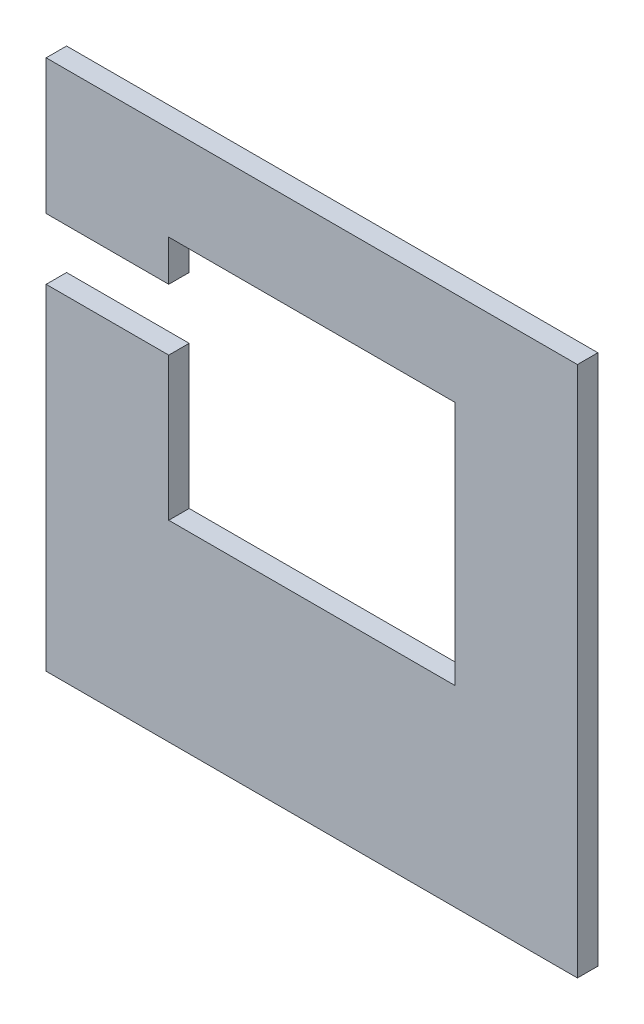
ISO-10303-21;
HEADER;
FILE_DESCRIPTION(('STEP AP214'),'2;1');
FILE_NAME('part.step','',(''),(''),'','','');
FILE_SCHEMA(('AUTOMOTIVE_DESIGN { 1 0 10303 214 1 1 1 1 }'));
ENDSEC;
DATA;
#1=APPLICATION_CONTEXT('core data for automotive mechanical design processes');
#2=APPLICATION_PROTOCOL_DEFINITION('international standard','automotive_design',2000,#1);
#3=PRODUCT_CONTEXT('',#1,'mechanical');
#4=PRODUCT('Part','Part','',(#3));
#5=PRODUCT_RELATED_PRODUCT_CATEGORY('part','',(#4));
#6=PRODUCT_DEFINITION_FORMATION('','',#4);
#7=PRODUCT_DEFINITION_CONTEXT('part definition',#1,'design');
#8=PRODUCT_DEFINITION('design','',#6,#7);
#9=PRODUCT_DEFINITION_SHAPE('','',#8);
#10=(LENGTH_UNIT() NAMED_UNIT(*) SI_UNIT(.MILLI.,.METRE.));
#11=(NAMED_UNIT(*) PLANE_ANGLE_UNIT() SI_UNIT($,.RADIAN.));
#12=(NAMED_UNIT(*) SI_UNIT($,.STERADIAN.) SOLID_ANGLE_UNIT());
#13=UNCERTAINTY_MEASURE_WITH_UNIT(LENGTH_MEASURE(1.E-05),#10,'distance_accuracy_value','');
#14=(GEOMETRIC_REPRESENTATION_CONTEXT(3) GLOBAL_UNCERTAINTY_ASSIGNED_CONTEXT((#13)) GLOBAL_UNIT_ASSIGNED_CONTEXT((#10,
#11,#12)) REPRESENTATION_CONTEXT('',''));
#15=CARTESIAN_POINT('',(0.,0.,0.));
#16=DIRECTION('',(0.,0.,1.));
#17=DIRECTION('',(1.,0.,0.));
#18=AXIS2_PLACEMENT_3D('',#15,#16,#17);
#19=CARTESIAN_POINT('',(-65.,-65.,5.));
#20=DIRECTION('',(1.,0.,0.));
#21=DIRECTION('',(0.,0.,-1.));
#22=AXIS2_PLACEMENT_3D('',#19,#20,#21);
#23=PLANE('',#22);
#24=DIRECTION('',(0.,-1.,0.));
#25=VECTOR('',#24,1.);
#26=CARTESIAN_POINT('',(-65.,-65.,5.));
#27=LINE('',#26,#25);
#28=CARTESIAN_POINT('',(-65.,17.,5.));
#29=VERTEX_POINT('',#28);
#30=CARTESIAN_POINT('',(-65.,-65.,5.));
#31=VERTEX_POINT('',#30);
#32=EDGE_CURVE('E167',#29,#31,#27,.T.);
#33=ORIENTED_EDGE('',*,*,#32,.F.);
#34=DIRECTION('',(0.,0.,1.));
#35=VECTOR('',#34,1.);
#36=CARTESIAN_POINT('',(-65.,17.,-5.));
#37=LINE('',#36,#35);
#38=CARTESIAN_POINT('',(-65.,17.,0.));
#39=VERTEX_POINT('',#38);
#40=EDGE_CURVE('E202',#39,#29,#37,.T.);
#41=ORIENTED_EDGE('',*,*,#40,.F.);
#42=DIRECTION('',(0.,-1.,0.));
#43=VECTOR('',#42,1.);
#44=CARTESIAN_POINT('',(-65.,-65.,0.));
#45=LINE('',#44,#43);
#46=CARTESIAN_POINT('',(-65.,-65.,0.));
#47=VERTEX_POINT('',#46);
#48=EDGE_CURVE('E157',#39,#47,#45,.T.);
#49=ORIENTED_EDGE('',*,*,#48,.T.);
#50=DIRECTION('',(0.,0.,-1.));
#51=VECTOR('',#50,1.);
#52=CARTESIAN_POINT('',(-65.,-65.,5.));
#53=LINE('',#52,#51);
#54=EDGE_CURVE('E127',#31,#47,#53,.T.);
#55=ORIENTED_EDGE('',*,*,#54,.F.);
#56=EDGE_LOOP('',(#33,#41,#49,#55));
#57=FACE_BOUND('',#56,.T.);
#58=ADVANCED_FACE('F34',(#57),#23,.F.);
#59=CARTESIAN_POINT('',(-35.,-18.,0.));
#60=DIRECTION('',(-1.,0.,0.));
#61=DIRECTION('',(0.,-1.,0.));
#62=AXIS2_PLACEMENT_3D('',#59,#60,#61);
#63=PLANE('',#62);
#64=DIRECTION('',(0.,-1.,0.));
#65=VECTOR('',#64,1.);
#66=CARTESIAN_POINT('',(-35.,-18.,0.));
#67=LINE('',#66,#65);
#68=CARTESIAN_POINT('',(-35.,17.,0.));
#69=VERTEX_POINT('',#68);
#70=CARTESIAN_POINT('',(-35.,-18.,0.));
#71=VERTEX_POINT('',#70);
#72=EDGE_CURVE('E155',#69,#71,#67,.T.);
#73=ORIENTED_EDGE('',*,*,#72,.F.);
#74=DIRECTION('',(0.,0.,1.));
#75=VECTOR('',#74,1.);
#76=CARTESIAN_POINT('',(-35.,17.,0.));
#77=LINE('',#76,#75);
#78=CARTESIAN_POINT('',(-35.,17.,5.));
#79=VERTEX_POINT('',#78);
#80=EDGE_CURVE('E11',#69,#79,#77,.T.);
#81=ORIENTED_EDGE('',*,*,#80,.T.);
#82=DIRECTION('',(0.,-1.,0.));
#83=VECTOR('',#82,1.);
#84=CARTESIAN_POINT('',(-35.,-18.,5.));
#85=LINE('',#84,#83);
#86=CARTESIAN_POINT('',(-35.,-18.,5.));
#87=VERTEX_POINT('',#86);
#88=EDGE_CURVE('E141',#79,#87,#85,.T.);
#89=ORIENTED_EDGE('',*,*,#88,.T.);
#90=DIRECTION('',(0.,0.,1.));
#91=VECTOR('',#90,1.);
#92=CARTESIAN_POINT('',(-35.,-18.,0.));
#93=LINE('',#92,#91);
#94=EDGE_CURVE('E162',#71,#87,#93,.T.);
#95=ORIENTED_EDGE('',*,*,#94,.F.);
#96=EDGE_LOOP('',(#73,#81,#89,#95));
#97=FACE_BOUND('',#96,.T.);
#98=ADVANCED_FACE('F246',(#97),#63,.F.);
#99=CARTESIAN_POINT('',(-65.,65.,0.));
#100=VERTEX_POINT('',#99);
#101=CARTESIAN_POINT('',(-65.,32.,0.));
#102=VERTEX_POINT('',#101);
#103=EDGE_CURVE('E174',#100,#102,#45,.T.);
#104=ORIENTED_EDGE('',*,*,#103,.T.);
#105=DIRECTION('',(0.,0.,1.));
#106=VECTOR('',#105,1.);
#107=CARTESIAN_POINT('',(-65.,32.,-5.));
#108=LINE('',#107,#106);
#109=CARTESIAN_POINT('',(-65.,32.,5.));
#110=VERTEX_POINT('',#109);
#111=EDGE_CURVE('E219',#102,#110,#108,.T.);
#112=ORIENTED_EDGE('',*,*,#111,.T.);
#113=CARTESIAN_POINT('',(-65.,65.,5.));
#114=VERTEX_POINT('',#113);
#115=EDGE_CURVE('E135',#114,#110,#27,.T.);
#116=ORIENTED_EDGE('',*,*,#115,.F.);
#117=DIRECTION('',(0.,0.,-1.));
#118=VECTOR('',#117,1.);
#119=CARTESIAN_POINT('',(-65.,65.,5.));
#120=LINE('',#119,#118);
#121=EDGE_CURVE('E173',#114,#100,#120,.T.);
#122=ORIENTED_EDGE('',*,*,#121,.T.);
#123=EDGE_LOOP('',(#104,#112,#116,#122));
#124=FACE_BOUND('',#123,.T.);
#125=ADVANCED_FACE('F36',(#124),#23,.F.);
#126=CARTESIAN_POINT('',(65.,-65.,5.));
#127=DIRECTION('',(0.,1.,0.));
#128=DIRECTION('',(-1.,0.,0.));
#129=AXIS2_PLACEMENT_3D('',#126,#127,#128);
#130=PLANE('',#129);
#131=DIRECTION('',(1.,0.,0.));
#132=VECTOR('',#131,1.);
#133=CARTESIAN_POINT('',(65.,-65.,0.));
#134=LINE('',#133,#132);
#135=CARTESIAN_POINT('',(65.,-65.,0.));
#136=VERTEX_POINT('',#135);
#137=EDGE_CURVE('E177',#47,#136,#134,.T.);
#138=ORIENTED_EDGE('',*,*,#137,.T.);
#139=DIRECTION('',(0.,0.,-1.));
#140=VECTOR('',#139,1.);
#141=CARTESIAN_POINT('',(65.,-65.,5.));
#142=LINE('',#141,#140);
#143=CARTESIAN_POINT('',(65.,-65.,5.));
#144=VERTEX_POINT('',#143);
#145=EDGE_CURVE('E188',#144,#136,#142,.T.);
#146=ORIENTED_EDGE('',*,*,#145,.F.);
#147=DIRECTION('',(1.,0.,0.));
#148=VECTOR('',#147,1.);
#149=CARTESIAN_POINT('',(65.,-65.,5.));
#150=LINE('',#149,#148);
#151=EDGE_CURVE('E166',#31,#144,#150,.T.);
#152=ORIENTED_EDGE('',*,*,#151,.F.);
#153=ORIENTED_EDGE('',*,*,#54,.T.);
#154=EDGE_LOOP('',(#138,#146,#152,#153));
#155=FACE_BOUND('',#154,.T.);
#156=ADVANCED_FACE('F195',(#155),#130,.F.);
#157=CARTESIAN_POINT('',(65.,-65.,5.));
#158=DIRECTION('',(-1.,0.,0.));
#159=DIRECTION('',(0.,0.,1.));
#160=AXIS2_PLACEMENT_3D('',#157,#158,#159);
#161=PLANE('',#160);
#162=DIRECTION('',(0.,1.,0.));
#163=VECTOR('',#162,1.);
#164=CARTESIAN_POINT('',(65.,-65.,0.));
#165=LINE('',#164,#163);
#166=CARTESIAN_POINT('',(65.,65.,0.));
#167=VERTEX_POINT('',#166);
#168=EDGE_CURVE('E179',#136,#167,#165,.T.);
#169=ORIENTED_EDGE('',*,*,#168,.T.);
#170=DIRECTION('',(0.,0.,-1.));
#171=VECTOR('',#170,1.);
#172=CARTESIAN_POINT('',(65.,65.,5.));
#173=LINE('',#172,#171);
#174=CARTESIAN_POINT('',(65.,65.,5.));
#175=VERTEX_POINT('',#174);
#176=EDGE_CURVE('E185',#175,#167,#173,.T.);
#177=ORIENTED_EDGE('',*,*,#176,.F.);
#178=DIRECTION('',(0.,1.,0.));
#179=VECTOR('',#178,1.);
#180=CARTESIAN_POINT('',(65.,-65.,5.));
#181=LINE('',#180,#179);
#182=EDGE_CURVE('E169',#144,#175,#181,.T.);
#183=ORIENTED_EDGE('',*,*,#182,.F.);
#184=ORIENTED_EDGE('',*,*,#145,.T.);
#185=EDGE_LOOP('',(#169,#177,#183,#184));
#186=FACE_BOUND('',#185,.T.);
#187=ADVANCED_FACE('F211',(#186),#161,.F.);
#188=CARTESIAN_POINT('',(65.,65.,5.));
#189=DIRECTION('',(0.,-1.,0.));
#190=DIRECTION('',(1.,0.,0.));
#191=AXIS2_PLACEMENT_3D('',#188,#189,#190);
#192=PLANE('',#191);
#193=DIRECTION('',(-1.,0.,0.));
#194=VECTOR('',#193,1.);
#195=CARTESIAN_POINT('',(65.,65.,0.));
#196=LINE('',#195,#194);
#197=EDGE_CURVE('E181',#167,#100,#196,.T.);
#198=ORIENTED_EDGE('',*,*,#197,.T.);
#199=ORIENTED_EDGE('',*,*,#121,.F.);
#200=DIRECTION('',(-1.,0.,0.));
#201=VECTOR('',#200,1.);
#202=CARTESIAN_POINT('',(65.,65.,5.));
#203=LINE('',#202,#201);
#204=EDGE_CURVE('E171',#175,#114,#203,.T.);
#205=ORIENTED_EDGE('',*,*,#204,.F.);
#206=ORIENTED_EDGE('',*,*,#176,.T.);
#207=EDGE_LOOP('',(#198,#199,#205,#206));
#208=FACE_BOUND('',#207,.T.);
#209=ADVANCED_FACE('F215',(#208),#192,.F.);
#210=CARTESIAN_POINT('',(0.,0.,5.));
#211=DIRECTION('',(0.,0.,1.));
#212=DIRECTION('',(1.,0.,0.));
#213=AXIS2_PLACEMENT_3D('',#210,#211,#212);
#214=PLANE('',#213);
#215=DIRECTION('',(1.,0.,0.));
#216=VECTOR('',#215,1.);
#217=CARTESIAN_POINT('',(-65.,17.,5.));
#218=LINE('',#217,#216);
#219=EDGE_CURVE('E57',#29,#79,#218,.T.);
#220=ORIENTED_EDGE('',*,*,#219,.F.);
#221=ORIENTED_EDGE('',*,*,#32,.T.);
#222=ORIENTED_EDGE('',*,*,#151,.T.);
#223=ORIENTED_EDGE('',*,*,#182,.T.);
#224=ORIENTED_EDGE('',*,*,#204,.T.);
#225=ORIENTED_EDGE('',*,*,#115,.T.);
#226=DIRECTION('',(-1.,0.,0.));
#227=VECTOR('',#226,1.);
#228=CARTESIAN_POINT('',(-65.,32.,5.));
#229=LINE('',#228,#227);
#230=CARTESIAN_POINT('',(-35.,32.,5.));
#231=VERTEX_POINT('',#230);
#232=EDGE_CURVE('E121',#231,#110,#229,.T.);
#233=ORIENTED_EDGE('',*,*,#232,.F.);
#234=CARTESIAN_POINT('',(-35.,42.,5.));
#235=VERTEX_POINT('',#234);
#236=EDGE_CURVE('E133',#235,#231,#85,.T.);
#237=ORIENTED_EDGE('',*,*,#236,.F.);
#238=DIRECTION('',(-1.,0.,0.));
#239=VECTOR('',#238,1.);
#240=CARTESIAN_POINT('',(35.,42.,5.));
#241=LINE('',#240,#239);
#242=CARTESIAN_POINT('',(35.,42.,5.));
#243=VERTEX_POINT('',#242);
#244=EDGE_CURVE('E153',#243,#235,#241,.T.);
#245=ORIENTED_EDGE('',*,*,#244,.F.);
#246=DIRECTION('',(0.,1.,0.));
#247=VECTOR('',#246,1.);
#248=CARTESIAN_POINT('',(35.,-18.,5.));
#249=LINE('',#248,#247);
#250=CARTESIAN_POINT('',(35.,-18.,5.));
#251=VERTEX_POINT('',#250);
#252=EDGE_CURVE('E144',#251,#243,#249,.T.);
#253=ORIENTED_EDGE('',*,*,#252,.F.);
#254=DIRECTION('',(1.,0.,0.));
#255=VECTOR('',#254,1.);
#256=CARTESIAN_POINT('',(35.,-18.,5.));
#257=LINE('',#256,#255);
#258=EDGE_CURVE('E140',#87,#251,#257,.T.);
#259=ORIENTED_EDGE('',*,*,#258,.F.);
#260=ORIENTED_EDGE('',*,*,#88,.F.);
#261=EDGE_LOOP('',(#220,#221,#222,#223,#224,#225,#233,#237,#245,#253,#259,#260));
#262=FACE_BOUND('',#261,.T.);
#263=ADVANCED_FACE('F131',(#262),#214,.T.);
#264=CARTESIAN_POINT('',(0.,0.,0.));
#265=DIRECTION('',(0.,0.,1.));
#266=DIRECTION('',(1.,0.,0.));
#267=AXIS2_PLACEMENT_3D('',#264,#265,#266);
#268=PLANE('',#267);
#269=ORIENTED_EDGE('',*,*,#48,.F.);
#270=DIRECTION('',(1.,0.,0.));
#271=VECTOR('',#270,1.);
#272=CARTESIAN_POINT('',(0.,17.,0.));
#273=LINE('',#272,#271);
#274=EDGE_CURVE('E146',#39,#69,#273,.T.);
#275=ORIENTED_EDGE('',*,*,#274,.T.);
#276=ORIENTED_EDGE('',*,*,#72,.T.);
#277=DIRECTION('',(1.,0.,0.));
#278=VECTOR('',#277,1.);
#279=CARTESIAN_POINT('',(35.,-18.,0.));
#280=LINE('',#279,#278);
#281=CARTESIAN_POINT('',(35.,-18.,0.));
#282=VERTEX_POINT('',#281);
#283=EDGE_CURVE('E228',#71,#282,#280,.T.);
#284=ORIENTED_EDGE('',*,*,#283,.T.);
#285=DIRECTION('',(0.,1.,0.));
#286=VECTOR('',#285,1.);
#287=CARTESIAN_POINT('',(35.,-18.,0.));
#288=LINE('',#287,#286);
#289=CARTESIAN_POINT('',(35.,42.,0.));
#290=VERTEX_POINT('',#289);
#291=EDGE_CURVE('E230',#282,#290,#288,.T.);
#292=ORIENTED_EDGE('',*,*,#291,.T.);
#293=DIRECTION('',(-1.,0.,0.));
#294=VECTOR('',#293,1.);
#295=CARTESIAN_POINT('',(35.,42.,0.));
#296=LINE('',#295,#294);
#297=CARTESIAN_POINT('',(-35.,42.,0.));
#298=VERTEX_POINT('',#297);
#299=EDGE_CURVE('E148',#290,#298,#296,.T.);
#300=ORIENTED_EDGE('',*,*,#299,.T.);
#301=CARTESIAN_POINT('',(-35.,32.,0.));
#302=VERTEX_POINT('',#301);
#303=EDGE_CURVE('E226',#298,#302,#67,.T.);
#304=ORIENTED_EDGE('',*,*,#303,.T.);
#305=DIRECTION('',(-1.,0.,0.));
#306=VECTOR('',#305,1.);
#307=CARTESIAN_POINT('',(0.,32.,0.));
#308=LINE('',#307,#306);
#309=EDGE_CURVE('E49',#302,#102,#308,.T.);
#310=ORIENTED_EDGE('',*,*,#309,.T.);
#311=ORIENTED_EDGE('',*,*,#103,.F.);
#312=ORIENTED_EDGE('',*,*,#197,.F.);
#313=ORIENTED_EDGE('',*,*,#168,.F.);
#314=ORIENTED_EDGE('',*,*,#137,.F.);
#315=EDGE_LOOP('',(#269,#275,#276,#284,#292,#300,#304,#310,#311,#312,#313,#314));
#316=FACE_BOUND('',#315,.T.);
#317=ADVANCED_FACE('F206',(#316),#268,.F.);
#318=ORIENTED_EDGE('',*,*,#236,.T.);
#319=DIRECTION('',(0.,0.,-1.));
#320=VECTOR('',#319,1.);
#321=CARTESIAN_POINT('',(-35.,32.,0.));
#322=LINE('',#321,#320);
#323=EDGE_CURVE('E42',#231,#302,#322,.T.);
#324=ORIENTED_EDGE('',*,*,#323,.T.);
#325=ORIENTED_EDGE('',*,*,#303,.F.);
#326=DIRECTION('',(0.,0.,1.));
#327=VECTOR('',#326,1.);
#328=CARTESIAN_POINT('',(-35.,42.,0.));
#329=LINE('',#328,#327);
#330=EDGE_CURVE('E138',#298,#235,#329,.T.);
#331=ORIENTED_EDGE('',*,*,#330,.T.);
#332=EDGE_LOOP('',(#318,#324,#325,#331));
#333=FACE_BOUND('',#332,.T.);
#334=ADVANCED_FACE('F137',(#333),#63,.F.);
#335=CARTESIAN_POINT('',(35.,42.,0.));
#336=DIRECTION('',(0.,1.,0.));
#337=DIRECTION('',(-1.,0.,0.));
#338=AXIS2_PLACEMENT_3D('',#335,#336,#337);
#339=PLANE('',#338);
#340=ORIENTED_EDGE('',*,*,#244,.T.);
#341=ORIENTED_EDGE('',*,*,#330,.F.);
#342=ORIENTED_EDGE('',*,*,#299,.F.);
#343=DIRECTION('',(0.,0.,1.));
#344=VECTOR('',#343,1.);
#345=CARTESIAN_POINT('',(35.,42.,0.));
#346=LINE('',#345,#344);
#347=EDGE_CURVE('E158',#290,#243,#346,.T.);
#348=ORIENTED_EDGE('',*,*,#347,.T.);
#349=EDGE_LOOP('',(#340,#341,#342,#348));
#350=FACE_BOUND('',#349,.T.);
#351=ADVANCED_FACE('F235',(#350),#339,.F.);
#352=CARTESIAN_POINT('',(35.,-18.,0.));
#353=DIRECTION('',(1.,0.,0.));
#354=DIRECTION('',(0.,1.,0.));
#355=AXIS2_PLACEMENT_3D('',#352,#353,#354);
#356=PLANE('',#355);
#357=ORIENTED_EDGE('',*,*,#252,.T.);
#358=ORIENTED_EDGE('',*,*,#347,.F.);
#359=ORIENTED_EDGE('',*,*,#291,.F.);
#360=DIRECTION('',(0.,0.,1.));
#361=VECTOR('',#360,1.);
#362=CARTESIAN_POINT('',(35.,-18.,0.));
#363=LINE('',#362,#361);
#364=EDGE_CURVE('E160',#282,#251,#363,.T.);
#365=ORIENTED_EDGE('',*,*,#364,.T.);
#366=EDGE_LOOP('',(#357,#358,#359,#365));
#367=FACE_BOUND('',#366,.T.);
#368=ADVANCED_FACE('F238',(#367),#356,.F.);
#369=CARTESIAN_POINT('',(35.,-18.,0.));
#370=DIRECTION('',(0.,-1.,0.));
#371=DIRECTION('',(1.,0.,0.));
#372=AXIS2_PLACEMENT_3D('',#369,#370,#371);
#373=PLANE('',#372);
#374=ORIENTED_EDGE('',*,*,#258,.T.);
#375=ORIENTED_EDGE('',*,*,#364,.F.);
#376=ORIENTED_EDGE('',*,*,#283,.F.);
#377=ORIENTED_EDGE('',*,*,#94,.T.);
#378=EDGE_LOOP('',(#374,#375,#376,#377));
#379=FACE_BOUND('',#378,.T.);
#380=ADVANCED_FACE('F242',(#379),#373,.F.);
#381=CARTESIAN_POINT('',(-65.,32.,-5.));
#382=DIRECTION('',(0.,1.,0.));
#383=DIRECTION('',(-1.,0.,0.));
#384=AXIS2_PLACEMENT_3D('',#381,#382,#383);
#385=PLANE('',#384);
#386=ORIENTED_EDGE('',*,*,#323,.F.);
#387=ORIENTED_EDGE('',*,*,#232,.T.);
#388=ORIENTED_EDGE('',*,*,#111,.F.);
#389=ORIENTED_EDGE('',*,*,#309,.F.);
#390=EDGE_LOOP('',(#386,#387,#388,#389));
#391=FACE_BOUND('',#390,.T.);
#392=ADVANCED_FACE('F120',(#391),#385,.F.);
#393=CARTESIAN_POINT('',(-65.,17.,-5.));
#394=DIRECTION('',(0.,-1.,0.));
#395=DIRECTION('',(0.,0.,-1.));
#396=AXIS2_PLACEMENT_3D('',#393,#394,#395);
#397=PLANE('',#396);
#398=ORIENTED_EDGE('',*,*,#40,.T.);
#399=ORIENTED_EDGE('',*,*,#219,.T.);
#400=ORIENTED_EDGE('',*,*,#80,.F.);
#401=ORIENTED_EDGE('',*,*,#274,.F.);
#402=EDGE_LOOP('',(#398,#399,#400,#401));
#403=FACE_BOUND('',#402,.T.);
#404=ADVANCED_FACE('F247',(#403),#397,.F.);
#405=CLOSED_SHELL('',(#58,#98,#125,#156,#187,#209,#263,#317,#334,#351,#368,#380,#392,#404));
#406=MANIFOLD_SOLID_BREP('B2',#405);
#407=ADVANCED_BREP_SHAPE_REPRESENTATION('',(#18,#406),#14);
#408=SHAPE_DEFINITION_REPRESENTATION(#9,#407);
ENDSEC;
END-ISO-10303-21;
